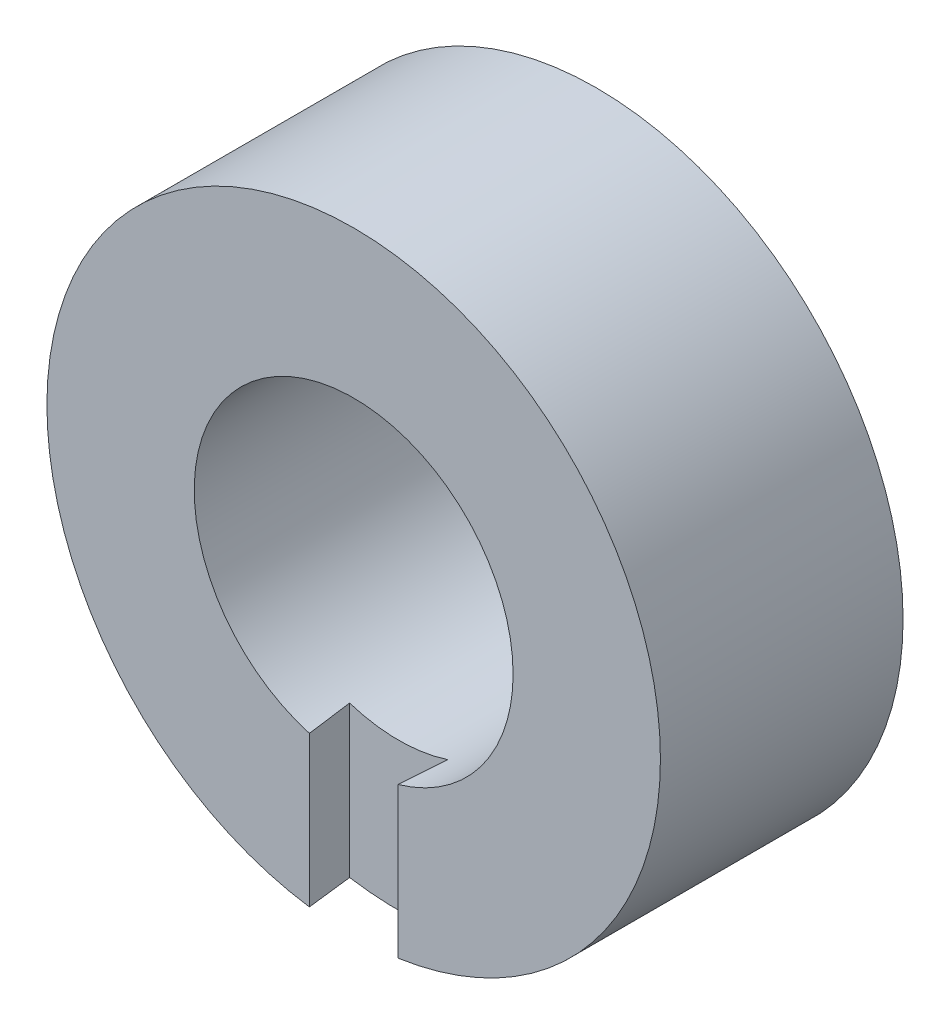
ISO-10303-21;
HEADER;
FILE_DESCRIPTION(('STEP AP214'),'2;1');
FILE_NAME('part.step','',(''),(''),'','','');
FILE_SCHEMA(('AUTOMOTIVE_DESIGN { 1 0 10303 214 1 1 1 1 }'));
ENDSEC;
DATA;
#1=APPLICATION_CONTEXT('core data for automotive mechanical design processes');
#2=APPLICATION_PROTOCOL_DEFINITION('international standard','automotive_design',2000,#1);
#3=PRODUCT_CONTEXT('',#1,'mechanical');
#4=PRODUCT('Part','Part','',(#3));
#5=PRODUCT_RELATED_PRODUCT_CATEGORY('part','',(#4));
#6=PRODUCT_DEFINITION_FORMATION('','',#4);
#7=PRODUCT_DEFINITION_CONTEXT('part definition',#1,'design');
#8=PRODUCT_DEFINITION('design','',#6,#7);
#9=PRODUCT_DEFINITION_SHAPE('','',#8);
#10=(LENGTH_UNIT() NAMED_UNIT(*) SI_UNIT(.MILLI.,.METRE.));
#11=(NAMED_UNIT(*) PLANE_ANGLE_UNIT() SI_UNIT($,.RADIAN.));
#12=(NAMED_UNIT(*) SI_UNIT($,.STERADIAN.) SOLID_ANGLE_UNIT());
#13=UNCERTAINTY_MEASURE_WITH_UNIT(LENGTH_MEASURE(1.E-05),#10,'distance_accuracy_value','');
#14=(GEOMETRIC_REPRESENTATION_CONTEXT(3) GLOBAL_UNCERTAINTY_ASSIGNED_CONTEXT((#13)) GLOBAL_UNIT_ASSIGNED_CONTEXT((#10,
#11,#12)) REPRESENTATION_CONTEXT('',''));
#15=CARTESIAN_POINT('',(0.,0.,0.));
#16=DIRECTION('',(0.,0.,1.));
#17=DIRECTION('',(1.,0.,0.));
#18=AXIS2_PLACEMENT_3D('',#15,#16,#17);
#19=CARTESIAN_POINT('',(2.67105331863495,29.0014554737997,7.62));
#20=DIRECTION('',(0.,0.,1.));
#21=DIRECTION('',(1.,0.,0.));
#22=AXIS2_PLACEMENT_3D('',#19,#20,#21);
#23=PLANE('',#22);
#24=CARTESIAN_POINT('',(0.,0.,7.62));
#25=DIRECTION('',(0.,0.,1.));
#26=DIRECTION('',(1.,0.,0.));
#27=AXIS2_PLACEMENT_3D('',#24,#25,#26);
#28=CIRCLE('',#27,9.65200000000004);
#29=CARTESIAN_POINT('',(9.65200000000004,0.,7.62));
#30=VERTEX_POINT('',#29);
#31=EDGE_CURVE('E11',#30,#30,#28,.F.);
#32=ORIENTED_EDGE('',*,*,#31,.T.);
#33=EDGE_LOOP('',(#32));
#34=FACE_BOUND('',#33,.T.);
#35=CARTESIAN_POINT('',(0.,0.,7.62));
#36=DIRECTION('',(0.,0.,1.));
#37=DIRECTION('',(1.,0.,0.));
#38=AXIS2_PLACEMENT_3D('',#35,#36,#37);
#39=CIRCLE('',#38,5.0165);
#40=CARTESIAN_POINT('',(5.0165,0.,7.62));
#41=VERTEX_POINT('',#40);
#42=EDGE_CURVE('E41',#41,#41,#39,.F.);
#43=ORIENTED_EDGE('',*,*,#42,.F.);
#44=EDGE_LOOP('',(#43));
#45=FACE_BOUND('',#44,.T.);
#46=ADVANCED_FACE('F38',(#34,#45),#23,.F.);
#47=CARTESIAN_POINT('',(-1.35953058351834,1.,15.5918387828429));
#48=DIRECTION('',(0.994660354368778,0.,-0.103202613566597));
#49=DIRECTION('',(-0.103202613566597,0.,-0.994660354368778));
#50=AXIS2_PLACEMENT_3D('',#47,#48,#49);
#51=PLANE('',#50);
#52=CARTESIAN_POINT('',(0.,0.,28.6949097734329));
#53=DIRECTION('',(0.994660354368778,0.,-0.103202613566597));
#54=DIRECTION('',(0.103202613566597,0.,0.994660354368778));
#55=AXIS2_PLACEMENT_3D('',#52,#53,#54);
#56=ELLIPSE('',#55,48.6082651071897,5.0165);
#57=CARTESIAN_POINT('',(-1.54113096886466,-4.77390695204738,13.8415855925444));
#58=VERTEX_POINT('',#57);
#59=CARTESIAN_POINT('',(-1.39447984291859,-4.81878596927626,15.255));
#60=VERTEX_POINT('',#59);
#61=EDGE_CURVE('E89',#58,#60,#56,.F.);
#62=ORIENTED_EDGE('',*,*,#61,.T.);
#63=DIRECTION('',(0.,1.,0.));
#64=VECTOR('',#63,1.);
#65=CARTESIAN_POINT('',(-1.39447984291859,0.,15.255));
#66=LINE('',#65,#64);
#67=CARTESIAN_POINT('',(-1.39447984291859,-9.55073452503494,15.255));
#68=VERTEX_POINT('',#67);
#69=EDGE_CURVE('E52',#68,#60,#66,.T.);
#70=ORIENTED_EDGE('',*,*,#69,.F.);
#71=CARTESIAN_POINT('',(0.,0.,28.6949097734329));
#72=DIRECTION('',(0.994660354368778,0.,-0.103202613566597));
#73=DIRECTION('',(0.103202613566597,0.,0.994660354368778));
#74=AXIS2_PLACEMENT_3D('',#71,#72,#73);
#75=ELLIPSE('',#74,93.5247632442134,9.65200000000004);
#76=CARTESIAN_POINT('',(-1.54113096886466,-9.52816977896631,13.8415855925444));
#77=VERTEX_POINT('',#76);
#78=EDGE_CURVE('E92',#77,#68,#75,.F.);
#79=ORIENTED_EDGE('',*,*,#78,.F.);
#80=DIRECTION('',(0.,-1.,0.));
#81=VECTOR('',#80,1.);
#82=CARTESIAN_POINT('',(-1.54113096886466,1.,13.8415855925444));
#83=LINE('',#82,#81);
#84=EDGE_CURVE('E82',#58,#77,#83,.T.);
#85=ORIENTED_EDGE('',*,*,#84,.F.);
#86=EDGE_LOOP('',(#62,#70,#79,#85));
#87=FACE_BOUND('',#86,.T.);
#88=ADVANCED_FACE('F91',(#87),#51,.T.);
#89=CARTESIAN_POINT('',(-1.54113096886466,1.,13.8415855925444));
#90=DIRECTION('',(0.,0.,1.));
#91=DIRECTION('',(1.,0.,0.));
#92=AXIS2_PLACEMENT_3D('',#89,#90,#91);
#93=PLANE('',#92);
#94=CARTESIAN_POINT('',(0.,0.,13.8415855925444));
#95=DIRECTION('',(0.,0.,1.));
#96=DIRECTION('',(1.,0.,0.));
#97=AXIS2_PLACEMENT_3D('',#94,#95,#96);
#98=CIRCLE('',#97,5.0165);
#99=CARTESIAN_POINT('',(1.54113096886466,-4.77390695204738,13.8415855925444));
#100=VERTEX_POINT('',#99);
#101=EDGE_CURVE('E79',#100,#58,#98,.F.);
#102=ORIENTED_EDGE('',*,*,#101,.T.);
#103=ORIENTED_EDGE('',*,*,#84,.T.);
#104=CARTESIAN_POINT('',(0.,0.,13.8415855925444));
#105=DIRECTION('',(0.,0.,1.));
#106=DIRECTION('',(1.,0.,0.));
#107=AXIS2_PLACEMENT_3D('',#104,#105,#106);
#108=CIRCLE('',#107,9.65200000000004);
#109=CARTESIAN_POINT('',(1.54113096886466,-9.52816977896632,13.8415855925444));
#110=VERTEX_POINT('',#109);
#111=EDGE_CURVE('E119',#110,#77,#108,.F.);
#112=ORIENTED_EDGE('',*,*,#111,.F.);
#113=DIRECTION('',(0.,-1.,0.));
#114=VECTOR('',#113,1.);
#115=CARTESIAN_POINT('',(1.54113096886466,1.,13.8415855925444));
#116=LINE('',#115,#114);
#117=EDGE_CURVE('E85',#100,#110,#116,.T.);
#118=ORIENTED_EDGE('',*,*,#117,.F.);
#119=EDGE_LOOP('',(#102,#103,#112,#118));
#120=FACE_BOUND('',#119,.T.);
#121=ADVANCED_FACE('F81',(#120),#93,.T.);
#122=CARTESIAN_POINT('',(1.35953058351834,1.,15.5918387828429));
#123=DIRECTION('',(-0.994660354368778,0.,-0.103202613566597));
#124=DIRECTION('',(-0.103202613566597,0.,0.994660354368778));
#125=AXIS2_PLACEMENT_3D('',#122,#123,#124);
#126=PLANE('',#125);
#127=CARTESIAN_POINT('',(0.,0.,28.6949097734329));
#128=DIRECTION('',(-0.994660354368778,0.,-0.103202613566597));
#129=DIRECTION('',(-0.103202613566597,0.,0.994660354368778));
#130=AXIS2_PLACEMENT_3D('',#127,#128,#129);
#131=ELLIPSE('',#130,48.6082651071897,5.0165);
#132=CARTESIAN_POINT('',(1.39447984291859,-4.81878596927626,15.255));
#133=VERTEX_POINT('',#132);
#134=EDGE_CURVE('E108',#133,#100,#131,.F.);
#135=ORIENTED_EDGE('',*,*,#134,.T.);
#136=ORIENTED_EDGE('',*,*,#117,.T.);
#137=CARTESIAN_POINT('',(0.,0.,28.6949097734329));
#138=DIRECTION('',(-0.994660354368778,0.,-0.103202613566597));
#139=DIRECTION('',(-0.103202613566597,0.,0.994660354368778));
#140=AXIS2_PLACEMENT_3D('',#137,#138,#139);
#141=ELLIPSE('',#140,93.5247632442134,9.65200000000004);
#142=CARTESIAN_POINT('',(1.39447984291859,-9.55073452503494,15.255));
#143=VERTEX_POINT('',#142);
#144=EDGE_CURVE('E122',#143,#110,#141,.F.);
#145=ORIENTED_EDGE('',*,*,#144,.F.);
#146=DIRECTION('',(0.,-1.,0.));
#147=VECTOR('',#146,1.);
#148=CARTESIAN_POINT('',(1.39447984291859,0.,15.255));
#149=LINE('',#148,#147);
#150=EDGE_CURVE('E60',#133,#143,#149,.T.);
#151=ORIENTED_EDGE('',*,*,#150,.F.);
#152=EDGE_LOOP('',(#135,#136,#145,#151));
#153=FACE_BOUND('',#152,.T.);
#154=ADVANCED_FACE('F146',(#153),#126,.T.);
#155=CARTESIAN_POINT('',(0.,0.,15.255));
#156=DIRECTION('',(0.,0.,1.));
#157=DIRECTION('',(1.,0.,0.));
#158=AXIS2_PLACEMENT_3D('',#155,#156,#157);
#159=PLANE('',#158);
#160=CARTESIAN_POINT('',(0.,0.,15.255));
#161=DIRECTION('',(0.,0.,1.));
#162=DIRECTION('',(1.,0.,0.));
#163=AXIS2_PLACEMENT_3D('',#160,#161,#162);
#164=CIRCLE('',#163,5.0165);
#165=EDGE_CURVE('E98',#60,#133,#164,.F.);
#166=ORIENTED_EDGE('',*,*,#165,.T.);
#167=ORIENTED_EDGE('',*,*,#150,.T.);
#168=CARTESIAN_POINT('',(0.,0.,15.255));
#169=DIRECTION('',(0.,0.,1.));
#170=DIRECTION('',(1.,0.,0.));
#171=AXIS2_PLACEMENT_3D('',#168,#169,#170);
#172=CIRCLE('',#171,9.65200000000004);
#173=EDGE_CURVE('E111',#68,#143,#172,.F.);
#174=ORIENTED_EDGE('',*,*,#173,.F.);
#175=ORIENTED_EDGE('',*,*,#69,.T.);
#176=EDGE_LOOP('',(#166,#167,#174,#175));
#177=FACE_BOUND('',#176,.T.);
#178=ADVANCED_FACE('F141',(#177),#159,.T.);
#179=CARTESIAN_POINT('',(0.,0.,5.08));
#180=DIRECTION('',(0.,0.,1.));
#181=DIRECTION('',(1.,0.,0.));
#182=AXIS2_PLACEMENT_3D('',#179,#180,#181);
#183=CYLINDRICAL_SURFACE('',#182,9.65200000000004);
#184=ORIENTED_EDGE('',*,*,#31,.F.);
#185=EDGE_LOOP('',(#184));
#186=FACE_BOUND('',#185,.T.);
#187=ORIENTED_EDGE('',*,*,#173,.T.);
#188=ORIENTED_EDGE('',*,*,#144,.T.);
#189=ORIENTED_EDGE('',*,*,#111,.T.);
#190=ORIENTED_EDGE('',*,*,#78,.T.);
#191=EDGE_LOOP('',(#187,#188,#189,#190));
#192=FACE_BOUND('',#191,.T.);
#193=ADVANCED_FACE('F139',(#186,#192),#183,.T.);
#194=CARTESIAN_POINT('',(0.,0.,0.));
#195=DIRECTION('',(0.,0.,1.));
#196=DIRECTION('',(1.,0.,0.));
#197=AXIS2_PLACEMENT_3D('',#194,#195,#196);
#198=CYLINDRICAL_SURFACE('',#197,5.0165);
#199=ORIENTED_EDGE('',*,*,#42,.T.);
#200=EDGE_LOOP('',(#199));
#201=FACE_BOUND('',#200,.T.);
#202=ORIENTED_EDGE('',*,*,#134,.F.);
#203=ORIENTED_EDGE('',*,*,#165,.F.);
#204=ORIENTED_EDGE('',*,*,#61,.F.);
#205=ORIENTED_EDGE('',*,*,#101,.F.);
#206=EDGE_LOOP('',(#202,#203,#204,#205));
#207=FACE_BOUND('',#206,.T.);
#208=ADVANCED_FACE('F96',(#201,#207),#198,.F.);
#209=CLOSED_SHELL('',(#46,#88,#121,#154,#178,#193,#208));
#210=MANIFOLD_SOLID_BREP('B2',#209);
#211=ADVANCED_BREP_SHAPE_REPRESENTATION('',(#18,#210),#14);
#212=SHAPE_DEFINITION_REPRESENTATION(#9,#211);
ENDSEC;
END-ISO-10303-21;
